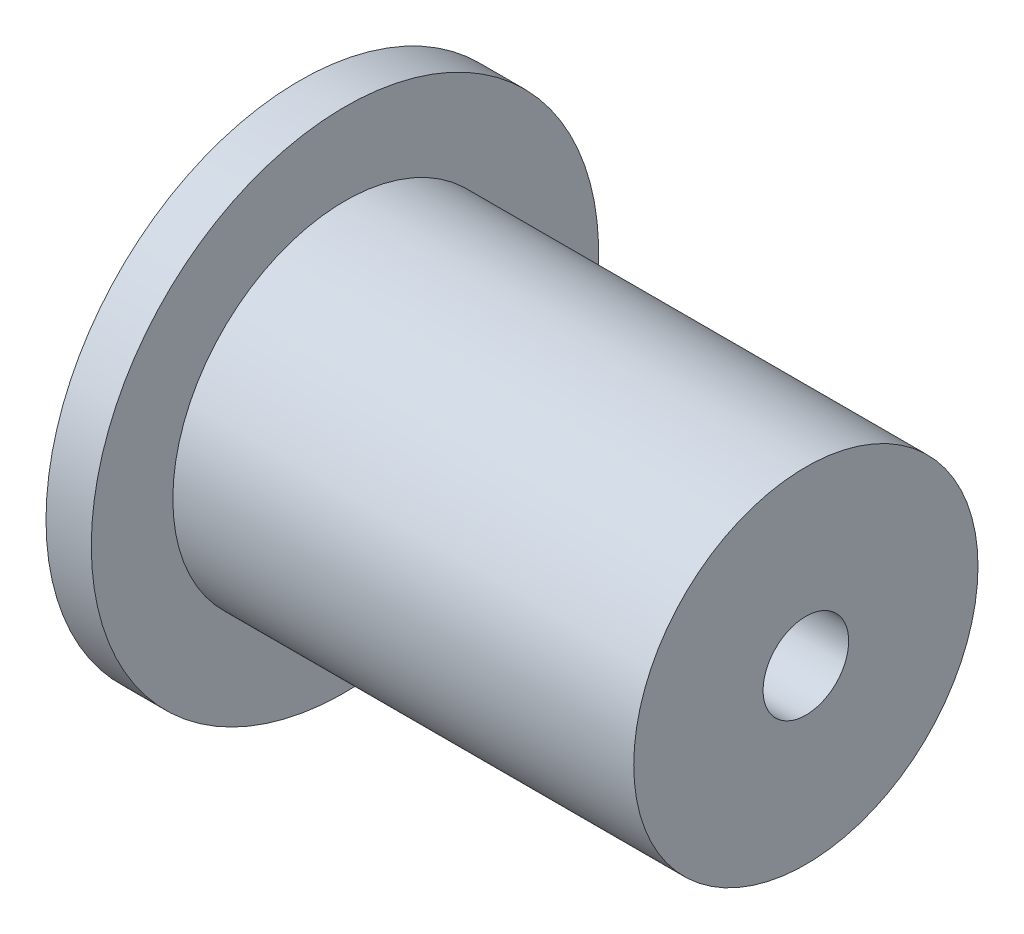
ISO-10303-21;
HEADER;
FILE_DESCRIPTION(('STEP AP214'),'2;1');
FILE_NAME('part.step','',(''),(''),'','','');
FILE_SCHEMA(('AUTOMOTIVE_DESIGN { 1 0 10303 214 1 1 1 1 }'));
ENDSEC;
DATA;
#1=APPLICATION_CONTEXT('core data for automotive mechanical design processes');
#2=APPLICATION_PROTOCOL_DEFINITION('international standard','automotive_design',2000,#1);
#3=PRODUCT_CONTEXT('',#1,'mechanical');
#4=PRODUCT('Part','Part','',(#3));
#5=PRODUCT_RELATED_PRODUCT_CATEGORY('part','',(#4));
#6=PRODUCT_DEFINITION_FORMATION('','',#4);
#7=PRODUCT_DEFINITION_CONTEXT('part definition',#1,'design');
#8=PRODUCT_DEFINITION('design','',#6,#7);
#9=PRODUCT_DEFINITION_SHAPE('','',#8);
#10=(LENGTH_UNIT() NAMED_UNIT(*) SI_UNIT(.MILLI.,.METRE.));
#11=(NAMED_UNIT(*) PLANE_ANGLE_UNIT() SI_UNIT($,.RADIAN.));
#12=(NAMED_UNIT(*) SI_UNIT($,.STERADIAN.) SOLID_ANGLE_UNIT());
#13=UNCERTAINTY_MEASURE_WITH_UNIT(LENGTH_MEASURE(1.E-05),#10,'distance_accuracy_value','');
#14=(GEOMETRIC_REPRESENTATION_CONTEXT(3) GLOBAL_UNCERTAINTY_ASSIGNED_CONTEXT((#13)) GLOBAL_UNIT_ASSIGNED_CONTEXT((#10,
#11,#12)) REPRESENTATION_CONTEXT('',''));
#15=CARTESIAN_POINT('',(0.,0.,0.));
#16=DIRECTION('',(0.,0.,1.));
#17=DIRECTION('',(1.,0.,0.));
#18=AXIS2_PLACEMENT_3D('',#15,#16,#17);
#19=CARTESIAN_POINT('',(0.,18.542,0.));
#20=DIRECTION('',(1.,0.,0.));
#21=DIRECTION('',(0.,0.,-1.));
#22=AXIS2_PLACEMENT_3D('',#19,#20,#21);
#23=PLANE('',#22);
#24=CARTESIAN_POINT('',(0.,0.,0.));
#25=DIRECTION('',(-1.,0.,0.));
#26=DIRECTION('',(0.,0.,1.));
#27=AXIS2_PLACEMENT_3D('',#24,#25,#26);
#28=CIRCLE('',#27,18.542);
#29=CARTESIAN_POINT('',(0.,0.,18.542));
#30=VERTEX_POINT('',#29);
#31=EDGE_CURVE('E72',#30,#30,#28,.T.);
#32=ORIENTED_EDGE('',*,*,#31,.F.);
#33=EDGE_LOOP('',(#32));
#34=FACE_BOUND('',#33,.T.);
#35=CARTESIAN_POINT('',(0.,0.,0.));
#36=DIRECTION('',(-1.,0.,0.));
#37=DIRECTION('',(0.,0.,1.));
#38=AXIS2_PLACEMENT_3D('',#35,#36,#37);
#39=CIRCLE('',#38,20.381214);
#40=CARTESIAN_POINT('',(0.,0.,20.381214));
#41=VERTEX_POINT('',#40);
#42=EDGE_CURVE('E94',#41,#41,#39,.T.);
#43=ORIENTED_EDGE('',*,*,#42,.T.);
#44=EDGE_LOOP('',(#43));
#45=FACE_BOUND('',#44,.T.);
#46=ADVANCED_FACE('F37',(#34,#45),#23,.F.);
#47=CARTESIAN_POINT('',(70.9600054,24.13,0.));
#48=DIRECTION('',(-1.,0.,0.));
#49=DIRECTION('',(0.,0.,1.));
#50=AXIS2_PLACEMENT_3D('',#47,#48,#49);
#51=PLANE('',#50);
#52=CARTESIAN_POINT('',(70.9600054,0.,0.));
#53=DIRECTION('',(-1.,0.,0.));
#54=DIRECTION('',(0.,0.,1.));
#55=AXIS2_PLACEMENT_3D('',#52,#53,#54);
#56=CIRCLE('',#55,24.13);
#57=CARTESIAN_POINT('',(70.9600054,0.,24.13));
#58=VERTEX_POINT('',#57);
#59=EDGE_CURVE('E84',#58,#58,#56,.T.);
#60=ORIENTED_EDGE('',*,*,#59,.F.);
#61=EDGE_LOOP('',(#60));
#62=FACE_BOUND('',#61,.T.);
#63=CARTESIAN_POINT('',(70.9600054,0.,0.));
#64=DIRECTION('',(-1.,0.,0.));
#65=DIRECTION('',(0.,0.,1.));
#66=AXIS2_PLACEMENT_3D('',#63,#64,#65);
#67=CIRCLE('',#66,5.999988);
#68=CARTESIAN_POINT('',(70.9600054,0.,5.999988));
#69=VERTEX_POINT('',#68);
#70=EDGE_CURVE('E10',#69,#69,#67,.T.);
#71=ORIENTED_EDGE('',*,*,#70,.T.);
#72=EDGE_LOOP('',(#71));
#73=FACE_BOUND('',#72,.T.);
#74=ADVANCED_FACE('F39',(#62,#73),#51,.F.);
#75=CARTESIAN_POINT('',(0.,0.,0.));
#76=DIRECTION('',(-1.,0.,0.));
#77=DIRECTION('',(0.,0.,1.));
#78=AXIS2_PLACEMENT_3D('',#75,#76,#77);
#79=CYLINDRICAL_SURFACE('',#78,5.999988);
#80=ORIENTED_EDGE('',*,*,#70,.F.);
#81=EDGE_LOOP('',(#80));
#82=FACE_BOUND('',#81,.T.);
#83=CARTESIAN_POINT('',(60.8000054,0.,0.));
#84=DIRECTION('',(-1.,0.,0.));
#85=DIRECTION('',(0.,0.,1.));
#86=AXIS2_PLACEMENT_3D('',#83,#84,#85);
#87=CIRCLE('',#86,5.999988);
#88=CARTESIAN_POINT('',(60.8000054,0.,5.999988));
#89=VERTEX_POINT('',#88);
#90=EDGE_CURVE('E44',#89,#89,#87,.T.);
#91=ORIENTED_EDGE('',*,*,#90,.T.);
#92=EDGE_LOOP('',(#91));
#93=FACE_BOUND('',#92,.T.);
#94=ADVANCED_FACE('F141',(#82,#93),#79,.F.);
#95=CARTESIAN_POINT('',(60.8000054,12.7,0.));
#96=DIRECTION('',(1.,0.,0.));
#97=DIRECTION('',(0.,0.,-1.));
#98=AXIS2_PLACEMENT_3D('',#95,#96,#97);
#99=PLANE('',#98);
#100=ORIENTED_EDGE('',*,*,#90,.F.);
#101=EDGE_LOOP('',(#100));
#102=FACE_BOUND('',#101,.T.);
#103=CARTESIAN_POINT('',(60.8000054,0.,0.));
#104=DIRECTION('',(-1.,0.,0.));
#105=DIRECTION('',(0.,0.,1.));
#106=AXIS2_PLACEMENT_3D('',#103,#104,#105);
#107=CIRCLE('',#106,12.7);
#108=CARTESIAN_POINT('',(60.8000054,0.,12.7));
#109=VERTEX_POINT('',#108);
#110=EDGE_CURVE('E48',#109,#109,#107,.T.);
#111=ORIENTED_EDGE('',*,*,#110,.T.);
#112=EDGE_LOOP('',(#111));
#113=FACE_BOUND('',#112,.T.);
#114=ADVANCED_FACE('F145',(#102,#113),#99,.F.);
#115=CARTESIAN_POINT('',(0.,0.,0.));
#116=DIRECTION('',(-1.,0.,0.));
#117=DIRECTION('',(0.,0.,1.));
#118=AXIS2_PLACEMENT_3D('',#115,#116,#117);
#119=CYLINDRICAL_SURFACE('',#118,12.7);
#120=ORIENTED_EDGE('',*,*,#110,.F.);
#121=EDGE_LOOP('',(#120));
#122=FACE_BOUND('',#121,.T.);
#123=CARTESIAN_POINT('',(48.1000054,0.,0.));
#124=DIRECTION('',(-1.,0.,0.));
#125=DIRECTION('',(0.,0.,1.));
#126=AXIS2_PLACEMENT_3D('',#123,#124,#125);
#127=CIRCLE('',#126,12.7);
#128=CARTESIAN_POINT('',(48.1000054,0.,12.7));
#129=VERTEX_POINT('',#128);
#130=EDGE_CURVE('E52',#129,#129,#127,.T.);
#131=ORIENTED_EDGE('',*,*,#130,.T.);
#132=EDGE_LOOP('',(#131));
#133=FACE_BOUND('',#132,.T.);
#134=ADVANCED_FACE('F176',(#122,#133),#119,.F.);
#135=CARTESIAN_POINT('',(48.1000054,12.7,0.));
#136=DIRECTION('',(1.,0.,0.));
#137=DIRECTION('',(0.,0.,-1.));
#138=AXIS2_PLACEMENT_3D('',#135,#136,#137);
#139=PLANE('',#138);
#140=ORIENTED_EDGE('',*,*,#130,.F.);
#141=EDGE_LOOP('',(#140));
#142=FACE_BOUND('',#141,.T.);
#143=CARTESIAN_POINT('',(48.1000054,0.,0.));
#144=DIRECTION('',(-1.,0.,0.));
#145=DIRECTION('',(0.,0.,1.));
#146=AXIS2_PLACEMENT_3D('',#143,#144,#145);
#147=CIRCLE('',#146,15.24);
#148=CARTESIAN_POINT('',(48.1000054,0.,15.24));
#149=VERTEX_POINT('',#148);
#150=EDGE_CURVE('E57',#149,#149,#147,.T.);
#151=ORIENTED_EDGE('',*,*,#150,.T.);
#152=EDGE_LOOP('',(#151));
#153=FACE_BOUND('',#152,.T.);
#154=ADVANCED_FACE('F172',(#142,#153),#139,.F.);
#155=CARTESIAN_POINT('',(0.,0.,0.));
#156=DIRECTION('',(-1.,0.,0.));
#157=DIRECTION('',(0.,0.,1.));
#158=AXIS2_PLACEMENT_3D('',#155,#156,#157);
#159=CYLINDRICAL_SURFACE('',#158,15.24);
#160=ORIENTED_EDGE('',*,*,#150,.F.);
#161=EDGE_LOOP('',(#160));
#162=FACE_BOUND('',#161,.T.);
#163=CARTESIAN_POINT('',(22.7000054,0.,0.));
#164=DIRECTION('',(-1.,0.,0.));
#165=DIRECTION('',(0.,0.,1.));
#166=AXIS2_PLACEMENT_3D('',#163,#164,#165);
#167=CIRCLE('',#166,15.24);
#168=CARTESIAN_POINT('',(22.7000054,0.,15.24));
#169=VERTEX_POINT('',#168);
#170=EDGE_CURVE('E60',#169,#169,#167,.T.);
#171=ORIENTED_EDGE('',*,*,#170,.T.);
#172=EDGE_LOOP('',(#171));
#173=FACE_BOUND('',#172,.T.);
#174=ADVANCED_FACE('F168',(#162,#173),#159,.F.);
#175=CARTESIAN_POINT('',(22.7000054,15.24,0.));
#176=DIRECTION('',(1.,0.,0.));
#177=DIRECTION('',(0.,0.,-1.));
#178=AXIS2_PLACEMENT_3D('',#175,#176,#177);
#179=PLANE('',#178);
#180=ORIENTED_EDGE('',*,*,#170,.F.);
#181=EDGE_LOOP('',(#180));
#182=FACE_BOUND('',#181,.T.);
#183=CARTESIAN_POINT('',(22.7000054,0.,0.));
#184=DIRECTION('',(-1.,0.,0.));
#185=DIRECTION('',(0.,0.,1.));
#186=AXIS2_PLACEMENT_3D('',#183,#184,#185);
#187=CIRCLE('',#186,16.002);
#188=CARTESIAN_POINT('',(22.7000054,0.,16.002));
#189=VERTEX_POINT('',#188);
#190=EDGE_CURVE('E63',#189,#189,#187,.T.);
#191=ORIENTED_EDGE('',*,*,#190,.T.);
#192=EDGE_LOOP('',(#191));
#193=FACE_BOUND('',#192,.T.);
#194=ADVANCED_FACE('F164',(#182,#193),#179,.F.);
#195=CARTESIAN_POINT('',(0.,0.,0.));
#196=DIRECTION('',(-1.,0.,0.));
#197=DIRECTION('',(0.,0.,1.));
#198=AXIS2_PLACEMENT_3D('',#195,#196,#197);
#199=CYLINDRICAL_SURFACE('',#198,16.002);
#200=ORIENTED_EDGE('',*,*,#190,.F.);
#201=EDGE_LOOP('',(#200));
#202=FACE_BOUND('',#201,.T.);
#203=CARTESIAN_POINT('',(12.7,0.,0.));
#204=DIRECTION('',(-1.,0.,0.));
#205=DIRECTION('',(0.,0.,1.));
#206=AXIS2_PLACEMENT_3D('',#203,#204,#205);
#207=CIRCLE('',#206,16.002);
#208=CARTESIAN_POINT('',(12.7,0.,16.002));
#209=VERTEX_POINT('',#208);
#210=EDGE_CURVE('E66',#209,#209,#207,.T.);
#211=ORIENTED_EDGE('',*,*,#210,.T.);
#212=EDGE_LOOP('',(#211));
#213=FACE_BOUND('',#212,.T.);
#214=ADVANCED_FACE('F160',(#202,#213),#199,.F.);
#215=CARTESIAN_POINT('',(12.7,16.002,0.));
#216=DIRECTION('',(1.,0.,0.));
#217=DIRECTION('',(0.,0.,-1.));
#218=AXIS2_PLACEMENT_3D('',#215,#216,#217);
#219=PLANE('',#218);
#220=ORIENTED_EDGE('',*,*,#210,.F.);
#221=EDGE_LOOP('',(#220));
#222=FACE_BOUND('',#221,.T.);
#223=CARTESIAN_POINT('',(12.7,0.,0.));
#224=DIRECTION('',(-1.,0.,0.));
#225=DIRECTION('',(0.,0.,1.));
#226=AXIS2_PLACEMENT_3D('',#223,#224,#225);
#227=CIRCLE('',#226,18.542);
#228=CARTESIAN_POINT('',(12.7,0.,18.542));
#229=VERTEX_POINT('',#228);
#230=EDGE_CURVE('E69',#229,#229,#227,.T.);
#231=ORIENTED_EDGE('',*,*,#230,.T.);
#232=EDGE_LOOP('',(#231));
#233=FACE_BOUND('',#232,.T.);
#234=ADVANCED_FACE('F156',(#222,#233),#219,.F.);
#235=CARTESIAN_POINT('',(0.,0.,0.));
#236=DIRECTION('',(-1.,0.,0.));
#237=DIRECTION('',(0.,0.,1.));
#238=AXIS2_PLACEMENT_3D('',#235,#236,#237);
#239=CYLINDRICAL_SURFACE('',#238,18.542);
#240=ORIENTED_EDGE('',*,*,#230,.F.);
#241=EDGE_LOOP('',(#240));
#242=FACE_BOUND('',#241,.T.);
#243=ORIENTED_EDGE('',*,*,#31,.T.);
#244=EDGE_LOOP('',(#243));
#245=FACE_BOUND('',#244,.T.);
#246=ADVANCED_FACE('F120',(#242,#245),#239,.F.);
#247=CARTESIAN_POINT('',(0.,0.,0.));
#248=DIRECTION('',(-1.,0.,0.));
#249=DIRECTION('',(0.,0.,1.));
#250=AXIS2_PLACEMENT_3D('',#247,#248,#249);
#251=CIRCLE('',#250,22.921214);
#252=CARTESIAN_POINT('',(0.,0.,22.921214));
#253=VERTEX_POINT('',#252);
#254=EDGE_CURVE('E88',#253,#253,#251,.T.);
#255=ORIENTED_EDGE('',*,*,#254,.F.);
#256=EDGE_LOOP('',(#255));
#257=FACE_BOUND('',#256,.T.);
#258=CARTESIAN_POINT('',(0.,0.,0.));
#259=DIRECTION('',(-1.,0.,0.));
#260=DIRECTION('',(0.,0.,1.));
#261=AXIS2_PLACEMENT_3D('',#258,#259,#260);
#262=CIRCLE('',#261,35.56);
#263=CARTESIAN_POINT('',(0.,0.,35.56));
#264=VERTEX_POINT('',#263);
#265=EDGE_CURVE('E75',#264,#264,#262,.T.);
#266=ORIENTED_EDGE('',*,*,#265,.T.);
#267=EDGE_LOOP('',(#266));
#268=FACE_BOUND('',#267,.T.);
#269=ADVANCED_FACE('F116',(#257,#268),#23,.F.);
#270=CARTESIAN_POINT('',(0.,0.,0.));
#271=DIRECTION('',(-1.,0.,0.));
#272=DIRECTION('',(0.,0.,1.));
#273=AXIS2_PLACEMENT_3D('',#270,#271,#272);
#274=CYLINDRICAL_SURFACE('',#273,35.56);
#275=ORIENTED_EDGE('',*,*,#265,.F.);
#276=EDGE_LOOP('',(#275));
#277=FACE_BOUND('',#276,.T.);
#278=CARTESIAN_POINT('',(6.35,0.,0.));
#279=DIRECTION('',(-1.,0.,0.));
#280=DIRECTION('',(0.,0.,1.));
#281=AXIS2_PLACEMENT_3D('',#278,#279,#280);
#282=CIRCLE('',#281,35.56);
#283=CARTESIAN_POINT('',(6.35,0.,35.56));
#284=VERTEX_POINT('',#283);
#285=EDGE_CURVE('E78',#284,#284,#282,.T.);
#286=ORIENTED_EDGE('',*,*,#285,.T.);
#287=EDGE_LOOP('',(#286));
#288=FACE_BOUND('',#287,.T.);
#289=ADVANCED_FACE('F119',(#277,#288),#274,.T.);
#290=CARTESIAN_POINT('',(6.35,35.56,0.));
#291=DIRECTION('',(-1.,0.,0.));
#292=DIRECTION('',(0.,0.,1.));
#293=AXIS2_PLACEMENT_3D('',#290,#291,#292);
#294=PLANE('',#293);
#295=ORIENTED_EDGE('',*,*,#285,.F.);
#296=EDGE_LOOP('',(#295));
#297=FACE_BOUND('',#296,.T.);
#298=CARTESIAN_POINT('',(6.35,0.,0.));
#299=DIRECTION('',(-1.,0.,0.));
#300=DIRECTION('',(0.,0.,1.));
#301=AXIS2_PLACEMENT_3D('',#298,#299,#300);
#302=CIRCLE('',#301,24.13);
#303=CARTESIAN_POINT('',(6.35,0.,24.13));
#304=VERTEX_POINT('',#303);
#305=EDGE_CURVE('E81',#304,#304,#302,.T.);
#306=ORIENTED_EDGE('',*,*,#305,.T.);
#307=EDGE_LOOP('',(#306));
#308=FACE_BOUND('',#307,.T.);
#309=ADVANCED_FACE('F126',(#297,#308),#294,.F.);
#310=CARTESIAN_POINT('',(0.,0.,0.));
#311=DIRECTION('',(-1.,0.,0.));
#312=DIRECTION('',(0.,0.,1.));
#313=AXIS2_PLACEMENT_3D('',#310,#311,#312);
#314=CYLINDRICAL_SURFACE('',#313,24.13);
#315=ORIENTED_EDGE('',*,*,#305,.F.);
#316=EDGE_LOOP('',(#315));
#317=FACE_BOUND('',#316,.T.);
#318=ORIENTED_EDGE('',*,*,#59,.T.);
#319=EDGE_LOOP('',(#318));
#320=FACE_BOUND('',#319,.T.);
#321=ADVANCED_FACE('F112',(#317,#320),#314,.T.);
#322=CARTESIAN_POINT('',(1.3462,0.,0.));
#323=DIRECTION('',(-1.,0.,0.));
#324=DIRECTION('',(0.,0.,1.));
#325=AXIS2_PLACEMENT_3D('',#322,#323,#324);
#326=CYLINDRICAL_SURFACE('',#325,22.921214);
#327=CARTESIAN_POINT('',(1.3462,0.,0.));
#328=DIRECTION('',(-1.,0.,0.));
#329=DIRECTION('',(0.,0.,1.));
#330=AXIS2_PLACEMENT_3D('',#327,#328,#329);
#331=CIRCLE('',#330,22.921214);
#332=CARTESIAN_POINT('',(1.3462,0.,22.921214));
#333=VERTEX_POINT('',#332);
#334=EDGE_CURVE('E87',#333,#333,#331,.T.);
#335=ORIENTED_EDGE('',*,*,#334,.F.);
#336=EDGE_LOOP('',(#335));
#337=FACE_BOUND('',#336,.T.);
#338=ORIENTED_EDGE('',*,*,#254,.T.);
#339=EDGE_LOOP('',(#338));
#340=FACE_BOUND('',#339,.T.);
#341=ADVANCED_FACE('F106',(#337,#340),#326,.F.);
#342=CARTESIAN_POINT('',(1.3462,0.,0.));
#343=DIRECTION('',(-1.,0.,0.));
#344=DIRECTION('',(0.,0.,1.));
#345=AXIS2_PLACEMENT_3D('',#342,#343,#344);
#346=PLANE('',#345);
#347=CARTESIAN_POINT('',(1.3462,0.,0.));
#348=DIRECTION('',(-1.,0.,0.));
#349=DIRECTION('',(0.,0.,1.));
#350=AXIS2_PLACEMENT_3D('',#347,#348,#349);
#351=CIRCLE('',#350,20.381214);
#352=CARTESIAN_POINT('',(1.3462,0.,20.381214));
#353=VERTEX_POINT('',#352);
#354=EDGE_CURVE('E91',#353,#353,#351,.T.);
#355=ORIENTED_EDGE('',*,*,#354,.F.);
#356=EDGE_LOOP('',(#355));
#357=FACE_BOUND('',#356,.T.);
#358=ORIENTED_EDGE('',*,*,#334,.T.);
#359=EDGE_LOOP('',(#358));
#360=FACE_BOUND('',#359,.T.);
#361=ADVANCED_FACE('F103',(#357,#360),#346,.T.);
#362=CARTESIAN_POINT('',(1.3462,0.,0.));
#363=DIRECTION('',(-1.,0.,0.));
#364=DIRECTION('',(0.,0.,1.));
#365=AXIS2_PLACEMENT_3D('',#362,#363,#364);
#366=CYLINDRICAL_SURFACE('',#365,20.381214);
#367=ORIENTED_EDGE('',*,*,#354,.T.);
#368=EDGE_LOOP('',(#367));
#369=FACE_BOUND('',#368,.T.);
#370=ORIENTED_EDGE('',*,*,#42,.F.);
#371=EDGE_LOOP('',(#370));
#372=FACE_BOUND('',#371,.T.);
#373=ADVANCED_FACE('F100',(#369,#372),#366,.T.);
#374=CLOSED_SHELL('',(#46,#74,#94,#114,#134,#154,#174,#194,#214,#234,#246,#269,#289,#309,#321,
#341,#361,#373));
#375=MANIFOLD_SOLID_BREP('B2',#374);
#376=ADVANCED_BREP_SHAPE_REPRESENTATION('',(#18,#375),#14);
#377=SHAPE_DEFINITION_REPRESENTATION(#9,#376);
ENDSEC;
END-ISO-10303-21;
